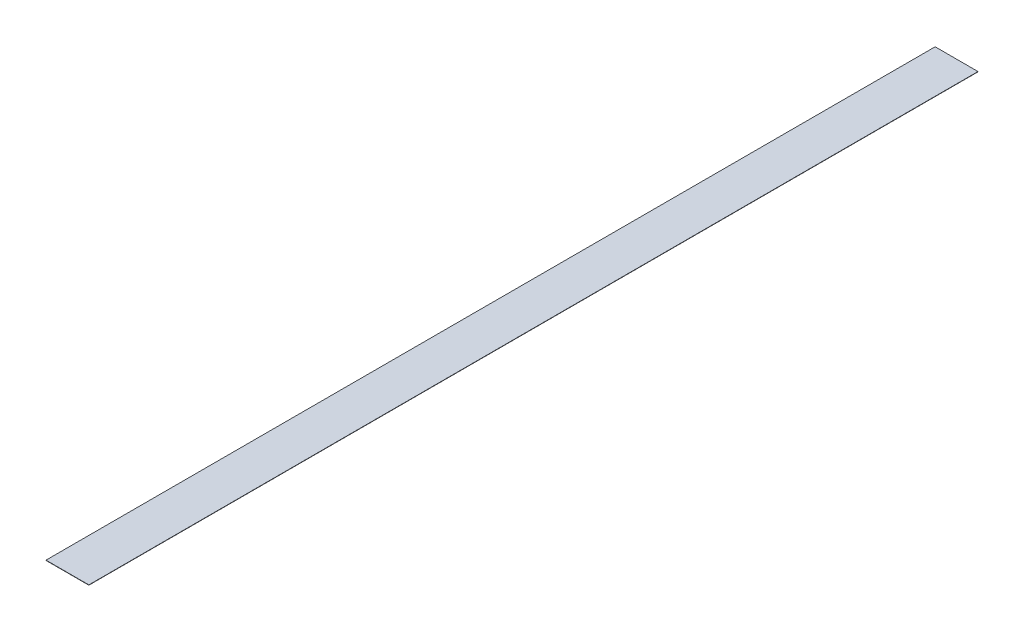
ISO-10303-21;
HEADER;
FILE_DESCRIPTION(('STEP AP214'),'2;1');
FILE_NAME('part.step','',(''),(''),'','','');
FILE_SCHEMA(('AUTOMOTIVE_DESIGN { 1 0 10303 214 1 1 1 1 }'));
ENDSEC;
DATA;
#1=APPLICATION_CONTEXT('core data for automotive mechanical design processes');
#2=APPLICATION_PROTOCOL_DEFINITION('international standard','automotive_design',2000,#1);
#3=PRODUCT_CONTEXT('',#1,'mechanical');
#4=PRODUCT('Part','Part','',(#3));
#5=PRODUCT_RELATED_PRODUCT_CATEGORY('part','',(#4));
#6=PRODUCT_DEFINITION_FORMATION('','',#4);
#7=PRODUCT_DEFINITION_CONTEXT('part definition',#1,'design');
#8=PRODUCT_DEFINITION('design','',#6,#7);
#9=PRODUCT_DEFINITION_SHAPE('','',#8);
#10=(LENGTH_UNIT() NAMED_UNIT(*) SI_UNIT(.MILLI.,.METRE.));
#11=(NAMED_UNIT(*) PLANE_ANGLE_UNIT() SI_UNIT($,.RADIAN.));
#12=(NAMED_UNIT(*) SI_UNIT($,.STERADIAN.) SOLID_ANGLE_UNIT());
#13=UNCERTAINTY_MEASURE_WITH_UNIT(LENGTH_MEASURE(1.E-05),#10,'distance_accuracy_value','');
#14=(GEOMETRIC_REPRESENTATION_CONTEXT(3) GLOBAL_UNCERTAINTY_ASSIGNED_CONTEXT((#13)) GLOBAL_UNIT_ASSIGNED_CONTEXT((#10,
#11,#12)) REPRESENTATION_CONTEXT('',''));
#15=CARTESIAN_POINT('',(0.,0.,0.));
#16=DIRECTION('',(0.,0.,1.));
#17=DIRECTION('',(1.,0.,0.));
#18=AXIS2_PLACEMENT_3D('',#15,#16,#17);
#19=CARTESIAN_POINT('',(-7.20500000000001,0.1,-149.5));
#20=DIRECTION('',(1.,0.,0.));
#21=DIRECTION('',(0.,0.,-1.));
#22=AXIS2_PLACEMENT_3D('',#19,#20,#21);
#23=PLANE('',#22);
#24=DIRECTION('',(0.,0.,1.));
#25=VECTOR('',#24,1.);
#26=CARTESIAN_POINT('',(-7.20500000000001,0.,-149.5));
#27=LINE('',#26,#25);
#28=CARTESIAN_POINT('',(-7.20500000000001,0.,-149.5));
#29=VERTEX_POINT('',#28);
#30=CARTESIAN_POINT('',(-7.20499999999997,0.,149.5));
#31=VERTEX_POINT('',#30);
#32=EDGE_CURVE('E95',#29,#31,#27,.T.);
#33=ORIENTED_EDGE('',*,*,#32,.T.);
#34=DIRECTION('',(0.,-1.,0.));
#35=VECTOR('',#34,1.);
#36=CARTESIAN_POINT('',(-7.20499999999997,0.1,149.5));
#37=LINE('',#36,#35);
#38=CARTESIAN_POINT('',(-7.20499999999997,0.1,149.5));
#39=VERTEX_POINT('',#38);
#40=EDGE_CURVE('E11',#39,#31,#37,.T.);
#41=ORIENTED_EDGE('',*,*,#40,.F.);
#42=DIRECTION('',(0.,0.,1.));
#43=VECTOR('',#42,1.);
#44=CARTESIAN_POINT('',(-7.20500000000001,0.1,-149.5));
#45=LINE('',#44,#43);
#46=CARTESIAN_POINT('',(-7.20500000000001,0.1,-149.5));
#47=VERTEX_POINT('',#46);
#48=EDGE_CURVE('E83',#47,#39,#45,.T.);
#49=ORIENTED_EDGE('',*,*,#48,.F.);
#50=DIRECTION('',(0.,-1.,0.));
#51=VECTOR('',#50,1.);
#52=CARTESIAN_POINT('',(-7.20500000000001,0.1,-149.5));
#53=LINE('',#52,#51);
#54=EDGE_CURVE('E91',#47,#29,#53,.T.);
#55=ORIENTED_EDGE('',*,*,#54,.T.);
#56=EDGE_LOOP('',(#33,#41,#49,#55));
#57=FACE_BOUND('',#56,.T.);
#58=ADVANCED_FACE('F32',(#57),#23,.F.);
#59=CARTESIAN_POINT('',(-7.20499999999997,0.1,149.5));
#60=DIRECTION('',(0.,0.,-1.));
#61=DIRECTION('',(-1.,0.,0.));
#62=AXIS2_PLACEMENT_3D('',#59,#60,#61);
#63=PLANE('',#62);
#64=DIRECTION('',(1.,0.,0.));
#65=VECTOR('',#64,1.);
#66=CARTESIAN_POINT('',(-7.20499999999997,0.,149.5));
#67=LINE('',#66,#65);
#68=CARTESIAN_POINT('',(7.20500000000003,0.,149.5));
#69=VERTEX_POINT('',#68);
#70=EDGE_CURVE('E87',#31,#69,#67,.T.);
#71=ORIENTED_EDGE('',*,*,#70,.T.);
#72=DIRECTION('',(0.,-1.,0.));
#73=VECTOR('',#72,1.);
#74=CARTESIAN_POINT('',(7.20500000000003,0.1,149.5));
#75=LINE('',#74,#73);
#76=CARTESIAN_POINT('',(7.20500000000003,0.1,149.5));
#77=VERTEX_POINT('',#76);
#78=EDGE_CURVE('E40',#77,#69,#75,.T.);
#79=ORIENTED_EDGE('',*,*,#78,.F.);
#80=DIRECTION('',(1.,0.,0.));
#81=VECTOR('',#80,1.);
#82=CARTESIAN_POINT('',(-7.20499999999997,0.1,149.5));
#83=LINE('',#82,#81);
#84=EDGE_CURVE('E78',#39,#77,#83,.T.);
#85=ORIENTED_EDGE('',*,*,#84,.F.);
#86=ORIENTED_EDGE('',*,*,#40,.T.);
#87=EDGE_LOOP('',(#71,#79,#85,#86));
#88=FACE_BOUND('',#87,.T.);
#89=ADVANCED_FACE('F86',(#88),#63,.F.);
#90=CARTESIAN_POINT('',(7.20499999999999,0.1,-149.5));
#91=DIRECTION('',(-1.,0.,0.));
#92=DIRECTION('',(0.,0.,1.));
#93=AXIS2_PLACEMENT_3D('',#90,#91,#92);
#94=PLANE('',#93);
#95=DIRECTION('',(0.,0.,-1.));
#96=VECTOR('',#95,1.);
#97=CARTESIAN_POINT('',(7.20499999999999,0.,-149.5));
#98=LINE('',#97,#96);
#99=CARTESIAN_POINT('',(7.20499999999999,0.,-149.5));
#100=VERTEX_POINT('',#99);
#101=EDGE_CURVE('E65',#69,#100,#98,.T.);
#102=ORIENTED_EDGE('',*,*,#101,.T.);
#103=DIRECTION('',(0.,-1.,0.));
#104=VECTOR('',#103,1.);
#105=CARTESIAN_POINT('',(7.20499999999999,0.1,-149.5));
#106=LINE('',#105,#104);
#107=CARTESIAN_POINT('',(7.20499999999999,0.1,-149.5));
#108=VERTEX_POINT('',#107);
#109=EDGE_CURVE('E88',#108,#100,#106,.T.);
#110=ORIENTED_EDGE('',*,*,#109,.F.);
#111=DIRECTION('',(0.,0.,-1.));
#112=VECTOR('',#111,1.);
#113=CARTESIAN_POINT('',(7.20499999999999,0.1,-149.5));
#114=LINE('',#113,#112);
#115=EDGE_CURVE('E81',#77,#108,#114,.T.);
#116=ORIENTED_EDGE('',*,*,#115,.F.);
#117=ORIENTED_EDGE('',*,*,#78,.T.);
#118=EDGE_LOOP('',(#102,#110,#116,#117));
#119=FACE_BOUND('',#118,.T.);
#120=ADVANCED_FACE('F89',(#119),#94,.F.);
#121=CARTESIAN_POINT('',(-7.20500000000001,0.1,-149.5));
#122=DIRECTION('',(0.,0.,1.));
#123=DIRECTION('',(1.,0.,0.));
#124=AXIS2_PLACEMENT_3D('',#121,#122,#123);
#125=PLANE('',#124);
#126=DIRECTION('',(-1.,0.,0.));
#127=VECTOR('',#126,1.);
#128=CARTESIAN_POINT('',(-7.20500000000001,0.,-149.5));
#129=LINE('',#128,#127);
#130=EDGE_CURVE('E71',#100,#29,#129,.T.);
#131=ORIENTED_EDGE('',*,*,#130,.T.);
#132=ORIENTED_EDGE('',*,*,#54,.F.);
#133=DIRECTION('',(-1.,0.,0.));
#134=VECTOR('',#133,1.);
#135=CARTESIAN_POINT('',(-7.20500000000001,0.1,-149.5));
#136=LINE('',#135,#134);
#137=EDGE_CURVE('E48',#108,#47,#136,.T.);
#138=ORIENTED_EDGE('',*,*,#137,.F.);
#139=ORIENTED_EDGE('',*,*,#109,.T.);
#140=EDGE_LOOP('',(#131,#132,#138,#139));
#141=FACE_BOUND('',#140,.T.);
#142=ADVANCED_FACE('F102',(#141),#125,.F.);
#143=CARTESIAN_POINT('',(-7.20499999999997,0.1,149.5));
#144=DIRECTION('',(0.,1.,0.));
#145=DIRECTION('',(0.,0.,1.));
#146=AXIS2_PLACEMENT_3D('',#143,#144,#145);
#147=PLANE('',#146);
#148=ORIENTED_EDGE('',*,*,#48,.T.);
#149=ORIENTED_EDGE('',*,*,#84,.T.);
#150=ORIENTED_EDGE('',*,*,#115,.T.);
#151=ORIENTED_EDGE('',*,*,#137,.T.);
#152=EDGE_LOOP('',(#148,#149,#150,#151));
#153=FACE_BOUND('',#152,.T.);
#154=ADVANCED_FACE('F79',(#153),#147,.T.);
#155=CARTESIAN_POINT('',(-7.20499999999997,0.,149.5));
#156=DIRECTION('',(0.,1.,0.));
#157=DIRECTION('',(0.,0.,1.));
#158=AXIS2_PLACEMENT_3D('',#155,#156,#157);
#159=PLANE('',#158);
#160=ORIENTED_EDGE('',*,*,#32,.F.);
#161=ORIENTED_EDGE('',*,*,#130,.F.);
#162=ORIENTED_EDGE('',*,*,#101,.F.);
#163=ORIENTED_EDGE('',*,*,#70,.F.);
#164=EDGE_LOOP('',(#160,#161,#162,#163));
#165=FACE_BOUND('',#164,.T.);
#166=ADVANCED_FACE('F105',(#165),#159,.F.);
#167=CLOSED_SHELL('',(#58,#89,#120,#142,#154,#166));
#168=MANIFOLD_SOLID_BREP('B2',#167);
#169=ADVANCED_BREP_SHAPE_REPRESENTATION('',(#18,#168),#14);
#170=SHAPE_DEFINITION_REPRESENTATION(#9,#169);
ENDSEC;
END-ISO-10303-21;
